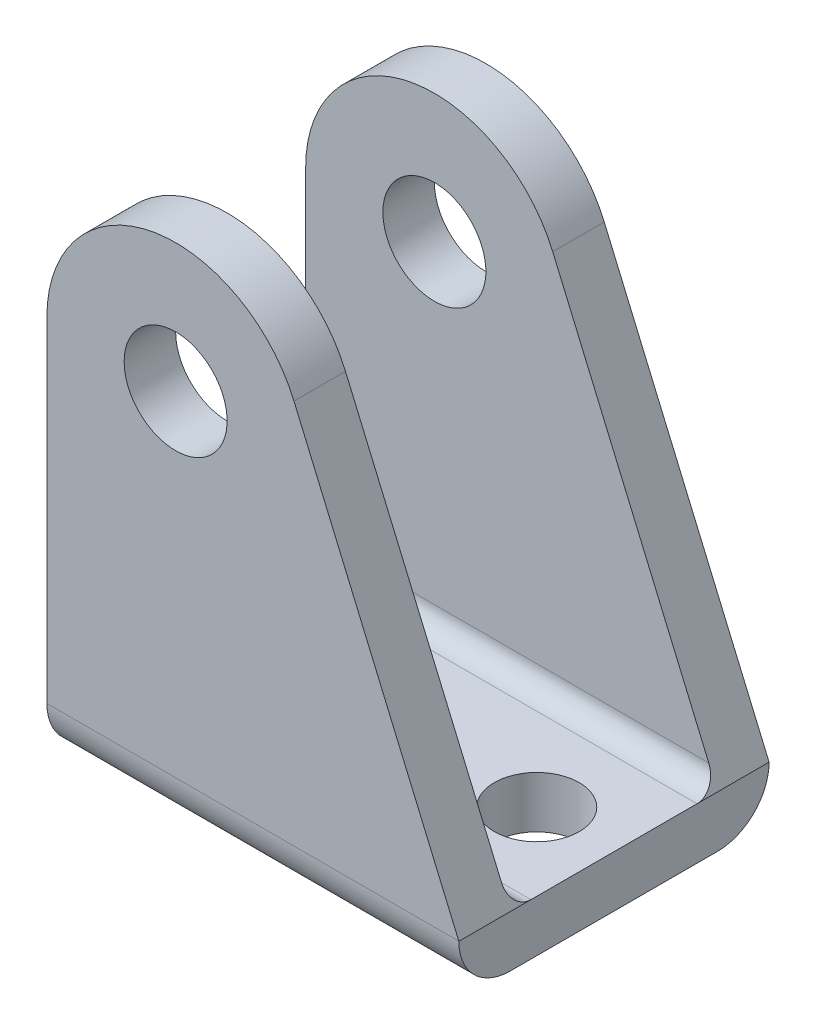
ISO-10303-21;
HEADER;
FILE_DESCRIPTION(('STEP AP214'),'2;1');
FILE_NAME('part.step','',(''),(''),'','','');
FILE_SCHEMA(('AUTOMOTIVE_DESIGN { 1 0 10303 214 1 1 1 1 }'));
ENDSEC;
DATA;
#1=APPLICATION_CONTEXT('core data for automotive mechanical design processes');
#2=APPLICATION_PROTOCOL_DEFINITION('international standard','automotive_design',2000,#1);
#3=PRODUCT_CONTEXT('',#1,'mechanical');
#4=PRODUCT('Part','Part','',(#3));
#5=PRODUCT_RELATED_PRODUCT_CATEGORY('part','',(#4));
#6=PRODUCT_DEFINITION_FORMATION('','',#4);
#7=PRODUCT_DEFINITION_CONTEXT('part definition',#1,'design');
#8=PRODUCT_DEFINITION('design','',#6,#7);
#9=PRODUCT_DEFINITION_SHAPE('','',#8);
#10=(LENGTH_UNIT() NAMED_UNIT(*) SI_UNIT(.MILLI.,.METRE.));
#11=(NAMED_UNIT(*) PLANE_ANGLE_UNIT() SI_UNIT($,.RADIAN.));
#12=(NAMED_UNIT(*) SI_UNIT($,.STERADIAN.) SOLID_ANGLE_UNIT());
#13=UNCERTAINTY_MEASURE_WITH_UNIT(LENGTH_MEASURE(1.E-05),#10,'distance_accuracy_value','');
#14=(GEOMETRIC_REPRESENTATION_CONTEXT(3) GLOBAL_UNCERTAINTY_ASSIGNED_CONTEXT((#13)) GLOBAL_UNIT_ASSIGNED_CONTEXT((#10,
#11,#12)) REPRESENTATION_CONTEXT('',''));
#15=CARTESIAN_POINT('',(0.,0.,0.));
#16=DIRECTION('',(0.,0.,1.));
#17=DIRECTION('',(1.,0.,0.));
#18=AXIS2_PLACEMENT_3D('',#15,#16,#17);
#19=CARTESIAN_POINT('',(32.,3.99999999999998,8.05000000000002));
#20=DIRECTION('',(-1.,0.,0.));
#21=DIRECTION('',(0.,0.,1.));
#22=AXIS2_PLACEMENT_3D('',#19,#20,#21);
#23=CYLINDRICAL_SURFACE('',#22,3.99999999999998);
#24=DIRECTION('',(-1.,0.,0.));
#25=VECTOR('',#24,1.);
#26=CARTESIAN_POINT('',(32.,4.,12.05));
#27=LINE('',#26,#25);
#28=CARTESIAN_POINT('',(32.,4.,12.05));
#29=VERTEX_POINT('',#28);
#30=CARTESIAN_POINT('',(0.,4.,12.05));
#31=VERTEX_POINT('',#30);
#32=EDGE_CURVE('E146',#29,#31,#27,.T.);
#33=ORIENTED_EDGE('',*,*,#32,.T.);
#34=CARTESIAN_POINT('',(0.,3.99999999999998,8.05000000000002));
#35=DIRECTION('',(1.,0.,0.));
#36=DIRECTION('',(0.,0.,-1.));
#37=AXIS2_PLACEMENT_3D('',#34,#35,#36);
#38=CIRCLE('',#37,3.99999999999998);
#39=CARTESIAN_POINT('',(0.,0.,8.05));
#40=VERTEX_POINT('',#39);
#41=EDGE_CURVE('E164',#31,#40,#38,.T.);
#42=ORIENTED_EDGE('',*,*,#41,.T.);
#43=DIRECTION('',(-1.,0.,0.));
#44=VECTOR('',#43,1.);
#45=CARTESIAN_POINT('',(32.,0.,8.05));
#46=LINE('',#45,#44);
#47=CARTESIAN_POINT('',(32.,0.,8.05));
#48=VERTEX_POINT('',#47);
#49=EDGE_CURVE('E222',#48,#40,#46,.T.);
#50=ORIENTED_EDGE('',*,*,#49,.F.);
#51=CARTESIAN_POINT('',(32.,3.99999999999998,8.05000000000002));
#52=DIRECTION('',(1.,0.,0.));
#53=DIRECTION('',(0.,0.,-1.));
#54=AXIS2_PLACEMENT_3D('',#51,#52,#53);
#55=CIRCLE('',#54,3.99999999999998);
#56=EDGE_CURVE('E195',#29,#48,#55,.T.);
#57=ORIENTED_EDGE('',*,*,#56,.F.);
#58=EDGE_LOOP('',(#33,#42,#50,#57));
#59=FACE_BOUND('',#58,.T.);
#60=ADVANCED_FACE('F33',(#59),#23,.T.);
#61=CARTESIAN_POINT('',(32.,0.,8.05));
#62=DIRECTION('',(0.,1.,0.));
#63=DIRECTION('',(0.,0.,1.));
#64=AXIS2_PLACEMENT_3D('',#61,#62,#63);
#65=PLANE('',#64);
#66=CARTESIAN_POINT('',(26.,0.,0.));
#67=DIRECTION('',(0.,1.,0.));
#68=DIRECTION('',(0.,0.,1.));
#69=AXIS2_PLACEMENT_3D('',#66,#67,#68);
#70=CIRCLE('',#69,3.3);
#71=CARTESIAN_POINT('',(26.,0.,3.3));
#72=VERTEX_POINT('',#71);
#73=EDGE_CURVE('E267',#72,#72,#70,.F.);
#74=ORIENTED_EDGE('',*,*,#73,.F.);
#75=EDGE_LOOP('',(#74));
#76=FACE_BOUND('',#75,.T.);
#77=CARTESIAN_POINT('',(6.,0.,0.));
#78=DIRECTION('',(0.,1.,0.));
#79=DIRECTION('',(0.,0.,1.));
#80=AXIS2_PLACEMENT_3D('',#77,#78,#79);
#81=CIRCLE('',#80,3.3);
#82=CARTESIAN_POINT('',(6.,0.,3.3));
#83=VERTEX_POINT('',#82);
#84=EDGE_CURVE('E261',#83,#83,#81,.F.);
#85=ORIENTED_EDGE('',*,*,#84,.F.);
#86=EDGE_LOOP('',(#85));
#87=FACE_BOUND('',#86,.T.);
#88=ORIENTED_EDGE('',*,*,#49,.T.);
#89=DIRECTION('',(0.,0.,-1.));
#90=VECTOR('',#89,1.);
#91=CARTESIAN_POINT('',(0.,0.,32.));
#92=LINE('',#91,#90);
#93=CARTESIAN_POINT('',(0.,0.,-8.05000000000001));
#94=VERTEX_POINT('',#93);
#95=EDGE_CURVE('E140',#40,#94,#92,.T.);
#96=ORIENTED_EDGE('',*,*,#95,.T.);
#97=DIRECTION('',(-1.,0.,0.));
#98=VECTOR('',#97,1.);
#99=CARTESIAN_POINT('',(32.,0.,-8.05));
#100=LINE('',#99,#98);
#101=CARTESIAN_POINT('',(32.,0.,-8.05));
#102=VERTEX_POINT('',#101);
#103=EDGE_CURVE('E219',#102,#94,#100,.T.);
#104=ORIENTED_EDGE('',*,*,#103,.F.);
#105=DIRECTION('',(0.,0.,-1.));
#106=VECTOR('',#105,1.);
#107=CARTESIAN_POINT('',(32.,0.,8.05));
#108=LINE('',#107,#106);
#109=EDGE_CURVE('E56',#48,#102,#108,.T.);
#110=ORIENTED_EDGE('',*,*,#109,.F.);
#111=EDGE_LOOP('',(#88,#96,#104,#110));
#112=FACE_BOUND('',#111,.T.);
#113=ADVANCED_FACE('F289',(#76,#87,#112),#65,.F.);
#114=CARTESIAN_POINT('',(32.,3.99999999999998,-8.05000000000002));
#115=DIRECTION('',(-1.,0.,0.));
#116=DIRECTION('',(0.,0.,1.));
#117=AXIS2_PLACEMENT_3D('',#114,#115,#116);
#118=CYLINDRICAL_SURFACE('',#117,3.99999999999998);
#119=ORIENTED_EDGE('',*,*,#103,.T.);
#120=CARTESIAN_POINT('',(0.,3.99999999999998,-8.05000000000002));
#121=DIRECTION('',(1.,0.,0.));
#122=DIRECTION('',(0.,0.,-1.));
#123=AXIS2_PLACEMENT_3D('',#120,#121,#122);
#124=CIRCLE('',#123,3.99999999999998);
#125=CARTESIAN_POINT('',(0.,4.,-12.05));
#126=VERTEX_POINT('',#125);
#127=EDGE_CURVE('E185',#94,#126,#124,.T.);
#128=ORIENTED_EDGE('',*,*,#127,.T.);
#129=DIRECTION('',(-1.,0.,0.));
#130=VECTOR('',#129,1.);
#131=CARTESIAN_POINT('',(32.,4.,-12.05));
#132=LINE('',#131,#130);
#133=CARTESIAN_POINT('',(32.,4.,-12.05));
#134=VERTEX_POINT('',#133);
#135=EDGE_CURVE('E216',#134,#126,#132,.T.);
#136=ORIENTED_EDGE('',*,*,#135,.F.);
#137=CARTESIAN_POINT('',(32.,3.99999999999998,-8.05000000000002));
#138=DIRECTION('',(1.,0.,0.));
#139=DIRECTION('',(0.,0.,-1.));
#140=AXIS2_PLACEMENT_3D('',#137,#138,#139);
#141=CIRCLE('',#140,3.99999999999998);
#142=EDGE_CURVE('E198',#102,#134,#141,.T.);
#143=ORIENTED_EDGE('',*,*,#142,.F.);
#144=EDGE_LOOP('',(#119,#128,#136,#143));
#145=FACE_BOUND('',#144,.T.);
#146=ADVANCED_FACE('F291',(#145),#118,.T.);
#147=CARTESIAN_POINT('',(32.,4.,-12.05));
#148=DIRECTION('',(0.,0.,1.));
#149=DIRECTION('',(1.,0.,0.));
#150=AXIS2_PLACEMENT_3D('',#147,#148,#149);
#151=PLANE('',#150);
#152=CARTESIAN_POINT('',(10.,30.,-12.05));
#153=DIRECTION('',(0.,0.,1.));
#154=DIRECTION('',(1.,0.,0.));
#155=AXIS2_PLACEMENT_3D('',#152,#153,#154);
#156=CIRCLE('',#155,4.);
#157=CARTESIAN_POINT('',(14.,30.,-12.05));
#158=VERTEX_POINT('',#157);
#159=EDGE_CURVE('E252',#158,#158,#156,.F.);
#160=ORIENTED_EDGE('',*,*,#159,.F.);
#161=EDGE_LOOP('',(#160));
#162=FACE_BOUND('',#161,.T.);
#163=ORIENTED_EDGE('',*,*,#135,.T.);
#164=DIRECTION('',(0.,1.,0.));
#165=VECTOR('',#164,1.);
#166=CARTESIAN_POINT('',(0.,4.,-12.05));
#167=LINE('',#166,#165);
#168=CARTESIAN_POINT('',(0.,30.,-12.05));
#169=VERTEX_POINT('',#168);
#170=EDGE_CURVE('E182',#126,#169,#167,.T.);
#171=ORIENTED_EDGE('',*,*,#170,.T.);
#172=CARTESIAN_POINT('',(10.,30.,-12.05));
#173=DIRECTION('',(0.,0.,1.));
#174=DIRECTION('',(1.,0.,0.));
#175=AXIS2_PLACEMENT_3D('',#172,#173,#174);
#176=CIRCLE('',#175,10.);
#177=CARTESIAN_POINT('',(19.1939540603206,33.9333457433482,-12.05));
#178=VERTEX_POINT('',#177);
#179=EDGE_CURVE('E193',#169,#178,#176,.F.);
#180=ORIENTED_EDGE('',*,*,#179,.T.);
#181=DIRECTION('',(0.393334574334815,-0.919395406032056,0.));
#182=VECTOR('',#181,1.);
#183=CARTESIAN_POINT('',(32.,4.,-12.05));
#184=LINE('',#183,#182);
#185=EDGE_CURVE('E161',#178,#134,#184,.T.);
#186=ORIENTED_EDGE('',*,*,#185,.T.);
#187=EDGE_LOOP('',(#163,#171,#180,#186));
#188=FACE_BOUND('',#187,.T.);
#189=ADVANCED_FACE('F299',(#162,#188),#151,.F.);
#190=CARTESIAN_POINT('',(32.,40.,-8.05));
#191=DIRECTION('',(0.,0.,-1.));
#192=DIRECTION('',(-1.,0.,0.));
#193=AXIS2_PLACEMENT_3D('',#190,#191,#192);
#194=PLANE('',#193);
#195=CARTESIAN_POINT('',(10.,30.,-8.05));
#196=DIRECTION('',(0.,0.,-1.));
#197=DIRECTION('',(-1.,0.,0.));
#198=AXIS2_PLACEMENT_3D('',#195,#196,#197);
#199=CIRCLE('',#198,4.);
#200=CARTESIAN_POINT('',(6.,30.,-8.05));
#201=VERTEX_POINT('',#200);
#202=EDGE_CURVE('E255',#201,#201,#199,.F.);
#203=ORIENTED_EDGE('',*,*,#202,.F.);
#204=EDGE_LOOP('',(#203));
#205=FACE_BOUND('',#204,.T.);
#206=CARTESIAN_POINT('',(10.,30.,-8.05));
#207=DIRECTION('',(0.,0.,-1.));
#208=DIRECTION('',(-1.,0.,0.));
#209=AXIS2_PLACEMENT_3D('',#206,#207,#208);
#210=CIRCLE('',#209,10.);
#211=CARTESIAN_POINT('',(19.1939540603206,33.9333457433482,-8.05));
#212=VERTEX_POINT('',#211);
#213=CARTESIAN_POINT('',(0.,30.,-8.05));
#214=VERTEX_POINT('',#213);
#215=EDGE_CURVE('E190',#212,#214,#210,.F.);
#216=ORIENTED_EDGE('',*,*,#215,.T.);
#217=DIRECTION('',(0.,-1.,0.));
#218=VECTOR('',#217,1.);
#219=CARTESIAN_POINT('',(0.,40.,-8.05));
#220=LINE('',#219,#218);
#221=CARTESIAN_POINT('',(0.,5.59999999999999,-8.05));
#222=VERTEX_POINT('',#221);
#223=EDGE_CURVE('E179',#214,#222,#220,.T.);
#224=ORIENTED_EDGE('',*,*,#223,.T.);
#225=DIRECTION('',(-1.,0.,0.));
#226=VECTOR('',#225,1.);
#227=CARTESIAN_POINT('',(32.,5.6,-8.05));
#228=LINE('',#227,#226);
#229=CARTESIAN_POINT('',(31.3154900331166,5.6,-8.05));
#230=VERTEX_POINT('',#229);
#231=EDGE_CURVE('E213',#230,#222,#228,.T.);
#232=ORIENTED_EDGE('',*,*,#231,.F.);
#233=DIRECTION('',(-0.393334574334815,0.919395406032056,0.));
#234=VECTOR('',#233,1.);
#235=CARTESIAN_POINT('',(18.9813199756279,34.4303648547826,-8.05));
#236=LINE('',#235,#234);
#237=EDGE_CURVE('E158',#230,#212,#236,.T.);
#238=ORIENTED_EDGE('',*,*,#237,.T.);
#239=EDGE_LOOP('',(#216,#224,#232,#238));
#240=FACE_BOUND('',#239,.T.);
#241=ADVANCED_FACE('F242',(#205,#240),#194,.F.);
#242=CARTESIAN_POINT('',(32.,5.59999999999999,-6.45000000000001));
#243=DIRECTION('',(-1.,0.,0.));
#244=DIRECTION('',(0.,0.,1.));
#245=AXIS2_PLACEMENT_3D('',#242,#243,#244);
#246=CYLINDRICAL_SURFACE('',#245,1.59999999999999);
#247=ORIENTED_EDGE('',*,*,#231,.T.);
#248=CARTESIAN_POINT('',(0.,5.59999999999999,-6.45000000000001));
#249=DIRECTION('',(1.,0.,0.));
#250=DIRECTION('',(0.,0.,-1.));
#251=AXIS2_PLACEMENT_3D('',#248,#249,#250);
#252=CIRCLE('',#251,1.59999999999999);
#253=CARTESIAN_POINT('',(0.,4.,-6.45));
#254=VERTEX_POINT('',#253);
#255=EDGE_CURVE('E176',#222,#254,#252,.F.);
#256=ORIENTED_EDGE('',*,*,#255,.T.);
#257=DIRECTION('',(-1.,0.,0.));
#258=VECTOR('',#257,1.);
#259=CARTESIAN_POINT('',(32.,4.,-6.45));
#260=LINE('',#259,#258);
#261=CARTESIAN_POINT('',(32.,4.,-6.45));
#262=VERTEX_POINT('',#261);
#263=EDGE_CURVE('E210',#262,#254,#260,.T.);
#264=ORIENTED_EDGE('',*,*,#263,.F.);
#265=CARTESIAN_POINT('',(31.3154900331167,5.59999999999999,-6.45000000000001));
#266=DIRECTION('',(-0.919395406032056,-0.393334574334815,0.));
#267=DIRECTION('',(-0.393334574334815,0.919395406032056,0.));
#268=AXIS2_PLACEMENT_3D('',#265,#266,#267);
#269=ELLIPSE('',#268,1.74027408610328,1.59999999999999);
#270=EDGE_CURVE('E48',#262,#230,#269,.F.);
#271=ORIENTED_EDGE('',*,*,#270,.T.);
#272=EDGE_LOOP('',(#247,#256,#264,#271));
#273=FACE_BOUND('',#272,.T.);
#274=ADVANCED_FACE('F239',(#273),#246,.F.);
#275=CARTESIAN_POINT('',(32.,4.,-6.45));
#276=DIRECTION('',(0.,-1.,0.));
#277=DIRECTION('',(0.,0.,-1.));
#278=AXIS2_PLACEMENT_3D('',#275,#276,#277);
#279=PLANE('',#278);
#280=CARTESIAN_POINT('',(26.,4.,0.));
#281=DIRECTION('',(0.,1.,0.));
#282=DIRECTION('',(0.,0.,1.));
#283=AXIS2_PLACEMENT_3D('',#280,#281,#282);
#284=CIRCLE('',#283,3.3);
#285=CARTESIAN_POINT('',(26.,4.,3.3));
#286=VERTEX_POINT('',#285);
#287=EDGE_CURVE('E270',#286,#286,#284,.T.);
#288=ORIENTED_EDGE('',*,*,#287,.F.);
#289=EDGE_LOOP('',(#288));
#290=FACE_BOUND('',#289,.T.);
#291=CARTESIAN_POINT('',(6.,4.,0.));
#292=DIRECTION('',(0.,1.,0.));
#293=DIRECTION('',(0.,0.,1.));
#294=AXIS2_PLACEMENT_3D('',#291,#292,#293);
#295=CIRCLE('',#294,3.3);
#296=CARTESIAN_POINT('',(6.,4.,3.3));
#297=VERTEX_POINT('',#296);
#298=EDGE_CURVE('E264',#297,#297,#295,.T.);
#299=ORIENTED_EDGE('',*,*,#298,.F.);
#300=EDGE_LOOP('',(#299));
#301=FACE_BOUND('',#300,.T.);
#302=ORIENTED_EDGE('',*,*,#263,.T.);
#303=DIRECTION('',(0.,0.,1.));
#304=VECTOR('',#303,1.);
#305=CARTESIAN_POINT('',(0.,4.,-6.45));
#306=LINE('',#305,#304);
#307=CARTESIAN_POINT('',(0.,4.,6.45));
#308=VERTEX_POINT('',#307);
#309=EDGE_CURVE('E173',#254,#308,#306,.T.);
#310=ORIENTED_EDGE('',*,*,#309,.T.);
#311=DIRECTION('',(-1.,0.,0.));
#312=VECTOR('',#311,1.);
#313=CARTESIAN_POINT('',(32.,4.,6.45));
#314=LINE('',#313,#312);
#315=CARTESIAN_POINT('',(32.,4.,6.45));
#316=VERTEX_POINT('',#315);
#317=EDGE_CURVE('E207',#316,#308,#314,.T.);
#318=ORIENTED_EDGE('',*,*,#317,.F.);
#319=DIRECTION('',(0.,0.,1.));
#320=VECTOR('',#319,1.);
#321=CARTESIAN_POINT('',(32.,4.,-6.45));
#322=LINE('',#321,#320);
#323=EDGE_CURVE('E200',#262,#316,#322,.T.);
#324=ORIENTED_EDGE('',*,*,#323,.F.);
#325=EDGE_LOOP('',(#302,#310,#318,#324));
#326=FACE_BOUND('',#325,.T.);
#327=ADVANCED_FACE('F235',(#290,#301,#326),#279,.F.);
#328=CARTESIAN_POINT('',(32.,5.59999999999999,6.45000000000001));
#329=DIRECTION('',(-1.,0.,0.));
#330=DIRECTION('',(0.,0.,1.));
#331=AXIS2_PLACEMENT_3D('',#328,#329,#330);
#332=CYLINDRICAL_SURFACE('',#331,1.59999999999999);
#333=ORIENTED_EDGE('',*,*,#317,.T.);
#334=CARTESIAN_POINT('',(0.,5.59999999999999,6.45000000000001));
#335=DIRECTION('',(1.,0.,0.));
#336=DIRECTION('',(0.,0.,-1.));
#337=AXIS2_PLACEMENT_3D('',#334,#335,#336);
#338=CIRCLE('',#337,1.59999999999999);
#339=CARTESIAN_POINT('',(0.,5.6,8.05));
#340=VERTEX_POINT('',#339);
#341=EDGE_CURVE('E170',#308,#340,#338,.F.);
#342=ORIENTED_EDGE('',*,*,#341,.T.);
#343=DIRECTION('',(-1.,0.,0.));
#344=VECTOR('',#343,1.);
#345=CARTESIAN_POINT('',(32.,5.6,8.05));
#346=LINE('',#345,#344);
#347=CARTESIAN_POINT('',(31.3154900331167,5.6,8.05));
#348=VERTEX_POINT('',#347);
#349=EDGE_CURVE('E204',#348,#340,#346,.T.);
#350=ORIENTED_EDGE('',*,*,#349,.F.);
#351=CARTESIAN_POINT('',(31.3154900331167,5.59999999999999,6.45000000000001));
#352=DIRECTION('',(-0.919395406032056,-0.393334574334815,0.));
#353=DIRECTION('',(-0.393334574334815,0.919395406032056,0.));
#354=AXIS2_PLACEMENT_3D('',#351,#352,#353);
#355=ELLIPSE('',#354,1.74027408610328,1.59999999999999);
#356=EDGE_CURVE('E149',#348,#316,#355,.F.);
#357=ORIENTED_EDGE('',*,*,#356,.T.);
#358=EDGE_LOOP('',(#333,#342,#350,#357));
#359=FACE_BOUND('',#358,.T.);
#360=ADVANCED_FACE('F229',(#359),#332,.F.);
#361=CARTESIAN_POINT('',(32.,5.6,8.05));
#362=DIRECTION('',(0.,0.,1.));
#363=DIRECTION('',(1.,0.,0.));
#364=AXIS2_PLACEMENT_3D('',#361,#362,#363);
#365=PLANE('',#364);
#366=CARTESIAN_POINT('',(10.,30.,8.05));
#367=DIRECTION('',(0.,0.,1.));
#368=DIRECTION('',(1.,0.,0.));
#369=AXIS2_PLACEMENT_3D('',#366,#367,#368);
#370=CIRCLE('',#369,4.);
#371=CARTESIAN_POINT('',(14.,30.,8.05));
#372=VERTEX_POINT('',#371);
#373=EDGE_CURVE('E258',#372,#372,#370,.F.);
#374=ORIENTED_EDGE('',*,*,#373,.F.);
#375=EDGE_LOOP('',(#374));
#376=FACE_BOUND('',#375,.T.);
#377=ORIENTED_EDGE('',*,*,#349,.T.);
#378=DIRECTION('',(0.,1.,0.));
#379=VECTOR('',#378,1.);
#380=CARTESIAN_POINT('',(0.,5.6,8.05));
#381=LINE('',#380,#379);
#382=CARTESIAN_POINT('',(0.,30.,8.05));
#383=VERTEX_POINT('',#382);
#384=EDGE_CURVE('E167',#340,#383,#381,.T.);
#385=ORIENTED_EDGE('',*,*,#384,.T.);
#386=CARTESIAN_POINT('',(10.,30.,8.05));
#387=DIRECTION('',(0.,0.,1.));
#388=DIRECTION('',(1.,0.,0.));
#389=AXIS2_PLACEMENT_3D('',#386,#387,#388);
#390=CIRCLE('',#389,10.);
#391=CARTESIAN_POINT('',(19.1939540603206,33.9333457433482,8.05));
#392=VERTEX_POINT('',#391);
#393=EDGE_CURVE('E188',#383,#392,#390,.F.);
#394=ORIENTED_EDGE('',*,*,#393,.T.);
#395=DIRECTION('',(0.393334574334815,-0.919395406032056,0.));
#396=VECTOR('',#395,1.);
#397=CARTESIAN_POINT('',(31.4213919989168,5.35246066021256,8.05));
#398=LINE('',#397,#396);
#399=EDGE_CURVE('E139',#392,#348,#398,.T.);
#400=ORIENTED_EDGE('',*,*,#399,.T.);
#401=EDGE_LOOP('',(#377,#385,#394,#400));
#402=FACE_BOUND('',#401,.T.);
#403=ADVANCED_FACE('F357',(#376,#402),#365,.F.);
#404=CARTESIAN_POINT('',(32.,40.,12.05));
#405=DIRECTION('',(0.,0.,-1.));
#406=DIRECTION('',(-1.,0.,0.));
#407=AXIS2_PLACEMENT_3D('',#404,#405,#406);
#408=PLANE('',#407);
#409=CARTESIAN_POINT('',(10.,30.,12.05));
#410=DIRECTION('',(0.,0.,-1.));
#411=DIRECTION('',(-1.,0.,0.));
#412=AXIS2_PLACEMENT_3D('',#409,#410,#411);
#413=CIRCLE('',#412,4.);
#414=CARTESIAN_POINT('',(6.,30.,12.05));
#415=VERTEX_POINT('',#414);
#416=EDGE_CURVE('E36',#415,#415,#413,.F.);
#417=ORIENTED_EDGE('',*,*,#416,.F.);
#418=EDGE_LOOP('',(#417));
#419=FACE_BOUND('',#418,.T.);
#420=CARTESIAN_POINT('',(10.,30.,12.05));
#421=DIRECTION('',(0.,0.,-1.));
#422=DIRECTION('',(-1.,0.,0.));
#423=AXIS2_PLACEMENT_3D('',#420,#421,#422);
#424=CIRCLE('',#423,10.);
#425=CARTESIAN_POINT('',(19.1939540603206,33.9333457433482,12.05));
#426=VERTEX_POINT('',#425);
#427=CARTESIAN_POINT('',(0.,30.,12.05));
#428=VERTEX_POINT('',#427);
#429=EDGE_CURVE('E41',#426,#428,#424,.F.);
#430=ORIENTED_EDGE('',*,*,#429,.T.);
#431=DIRECTION('',(0.,-1.,0.));
#432=VECTOR('',#431,1.);
#433=CARTESIAN_POINT('',(0.,40.,12.05));
#434=LINE('',#433,#432);
#435=EDGE_CURVE('E11',#428,#31,#434,.T.);
#436=ORIENTED_EDGE('',*,*,#435,.T.);
#437=ORIENTED_EDGE('',*,*,#32,.F.);
#438=DIRECTION('',(-0.393334574334815,0.919395406032056,0.));
#439=VECTOR('',#438,1.);
#440=CARTESIAN_POINT('',(18.9813199756279,34.4303648547826,12.05));
#441=LINE('',#440,#439);
#442=EDGE_CURVE('E136',#29,#426,#441,.T.);
#443=ORIENTED_EDGE('',*,*,#442,.T.);
#444=EDGE_LOOP('',(#430,#436,#437,#443));
#445=FACE_BOUND('',#444,.T.);
#446=ADVANCED_FACE('F144',(#419,#445),#408,.F.);
#447=CARTESIAN_POINT('',(32.,3.99999999999998,8.05000000000002));
#448=DIRECTION('',(1.,0.,0.));
#449=DIRECTION('',(0.,0.,-1.));
#450=AXIS2_PLACEMENT_3D('',#447,#448,#449);
#451=PLANE('',#450);
#452=DIRECTION('',(0.,0.,-1.));
#453=VECTOR('',#452,1.);
#454=CARTESIAN_POINT('',(32.,3.99999999999998,8.05000000000002));
#455=LINE('',#454,#453);
#456=EDGE_CURVE('E131',#29,#316,#455,.T.);
#457=ORIENTED_EDGE('',*,*,#456,.F.);
#458=ORIENTED_EDGE('',*,*,#56,.T.);
#459=ORIENTED_EDGE('',*,*,#109,.T.);
#460=ORIENTED_EDGE('',*,*,#142,.T.);
#461=EDGE_CURVE('E225',#262,#134,#455,.T.);
#462=ORIENTED_EDGE('',*,*,#461,.F.);
#463=ORIENTED_EDGE('',*,*,#323,.T.);
#464=EDGE_LOOP('',(#457,#458,#459,#460,#462,#463));
#465=FACE_BOUND('',#464,.T.);
#466=ADVANCED_FACE('F232',(#465),#451,.T.);
#467=CARTESIAN_POINT('',(10.,30.,32.));
#468=DIRECTION('',(0.,0.,-1.));
#469=DIRECTION('',(-1.,0.,0.));
#470=AXIS2_PLACEMENT_3D('',#467,#468,#469);
#471=CYLINDRICAL_SURFACE('',#470,10.);
#472=DIRECTION('',(0.,0.,-1.));
#473=VECTOR('',#472,1.);
#474=CARTESIAN_POINT('',(0.,30.,32.));
#475=LINE('',#474,#473);
#476=EDGE_CURVE('E151',#214,#169,#475,.T.);
#477=ORIENTED_EDGE('',*,*,#476,.F.);
#478=ORIENTED_EDGE('',*,*,#215,.F.);
#479=DIRECTION('',(0.,0.,-1.));
#480=VECTOR('',#479,1.);
#481=CARTESIAN_POINT('',(19.1939540603206,33.9333457433482,32.));
#482=LINE('',#481,#480);
#483=EDGE_CURVE('E141',#212,#178,#482,.T.);
#484=ORIENTED_EDGE('',*,*,#483,.T.);
#485=ORIENTED_EDGE('',*,*,#179,.F.);
#486=EDGE_LOOP('',(#477,#478,#484,#485));
#487=FACE_BOUND('',#486,.T.);
#488=ADVANCED_FACE('F246',(#487),#471,.T.);
#489=EDGE_CURVE('E127',#428,#383,#475,.T.);
#490=ORIENTED_EDGE('',*,*,#489,.F.);
#491=ORIENTED_EDGE('',*,*,#429,.F.);
#492=EDGE_CURVE('E125',#426,#392,#482,.T.);
#493=ORIENTED_EDGE('',*,*,#492,.T.);
#494=ORIENTED_EDGE('',*,*,#393,.F.);
#495=EDGE_LOOP('',(#490,#491,#493,#494));
#496=FACE_BOUND('',#495,.T.);
#497=ADVANCED_FACE('F124',(#496),#471,.T.);
#498=CARTESIAN_POINT('',(0.,30.,32.));
#499=DIRECTION('',(1.,0.,0.));
#500=DIRECTION('',(0.,0.,-1.));
#501=AXIS2_PLACEMENT_3D('',#498,#499,#500);
#502=PLANE('',#501);
#503=ORIENTED_EDGE('',*,*,#95,.F.);
#504=ORIENTED_EDGE('',*,*,#41,.F.);
#505=ORIENTED_EDGE('',*,*,#435,.F.);
#506=ORIENTED_EDGE('',*,*,#489,.T.);
#507=ORIENTED_EDGE('',*,*,#384,.F.);
#508=ORIENTED_EDGE('',*,*,#341,.F.);
#509=ORIENTED_EDGE('',*,*,#309,.F.);
#510=ORIENTED_EDGE('',*,*,#255,.F.);
#511=ORIENTED_EDGE('',*,*,#223,.F.);
#512=ORIENTED_EDGE('',*,*,#476,.T.);
#513=ORIENTED_EDGE('',*,*,#170,.F.);
#514=ORIENTED_EDGE('',*,*,#127,.F.);
#515=EDGE_LOOP('',(#503,#504,#505,#506,#507,#508,#509,#510,#511,#512,#513,#514));
#516=FACE_BOUND('',#515,.T.);
#517=ADVANCED_FACE('F237',(#516),#502,.F.);
#518=CARTESIAN_POINT('',(32.,4.,32.));
#519=DIRECTION('',(-0.919395406032056,-0.393334574334815,0.));
#520=DIRECTION('',(0.393334574334815,-0.919395406032056,0.));
#521=AXIS2_PLACEMENT_3D('',#518,#519,#520);
#522=PLANE('',#521);
#523=ORIENTED_EDGE('',*,*,#483,.F.);
#524=ORIENTED_EDGE('',*,*,#237,.F.);
#525=ORIENTED_EDGE('',*,*,#270,.F.);
#526=ORIENTED_EDGE('',*,*,#461,.T.);
#527=ORIENTED_EDGE('',*,*,#185,.F.);
#528=EDGE_LOOP('',(#523,#524,#525,#526,#527));
#529=FACE_BOUND('',#528,.T.);
#530=ADVANCED_FACE('F300',(#529),#522,.F.);
#531=ORIENTED_EDGE('',*,*,#399,.F.);
#532=ORIENTED_EDGE('',*,*,#492,.F.);
#533=ORIENTED_EDGE('',*,*,#442,.F.);
#534=ORIENTED_EDGE('',*,*,#456,.T.);
#535=ORIENTED_EDGE('',*,*,#356,.F.);
#536=EDGE_LOOP('',(#531,#532,#533,#534,#535));
#537=FACE_BOUND('',#536,.T.);
#538=ADVANCED_FACE('F135',(#537),#522,.F.);
#539=CARTESIAN_POINT('',(10.,30.,16.1));
#540=DIRECTION('',(0.,0.,-1.));
#541=DIRECTION('',(-1.,0.,0.));
#542=AXIS2_PLACEMENT_3D('',#539,#540,#541);
#543=CYLINDRICAL_SURFACE('',#542,4.);
#544=ORIENTED_EDGE('',*,*,#416,.T.);
#545=EDGE_LOOP('',(#544));
#546=FACE_BOUND('',#545,.T.);
#547=ORIENTED_EDGE('',*,*,#373,.T.);
#548=EDGE_LOOP('',(#547));
#549=FACE_BOUND('',#548,.T.);
#550=ADVANCED_FACE('F307',(#546,#549),#543,.F.);
#551=ORIENTED_EDGE('',*,*,#202,.T.);
#552=EDGE_LOOP('',(#551));
#553=FACE_BOUND('',#552,.T.);
#554=ORIENTED_EDGE('',*,*,#159,.T.);
#555=EDGE_LOOP('',(#554));
#556=FACE_BOUND('',#555,.T.);
#557=ADVANCED_FACE('F285',(#553,#556),#543,.F.);
#558=CARTESIAN_POINT('',(6.,4.,0.));
#559=DIRECTION('',(0.,-1.,0.));
#560=DIRECTION('',(0.,0.,-1.));
#561=AXIS2_PLACEMENT_3D('',#558,#559,#560);
#562=CYLINDRICAL_SURFACE('',#561,3.3);
#563=ORIENTED_EDGE('',*,*,#298,.T.);
#564=EDGE_LOOP('',(#563));
#565=FACE_BOUND('',#564,.T.);
#566=ORIENTED_EDGE('',*,*,#84,.T.);
#567=EDGE_LOOP('',(#566));
#568=FACE_BOUND('',#567,.T.);
#569=ADVANCED_FACE('F282',(#565,#568),#562,.F.);
#570=CARTESIAN_POINT('',(26.,4.,0.));
#571=DIRECTION('',(0.,-1.,0.));
#572=DIRECTION('',(0.,0.,-1.));
#573=AXIS2_PLACEMENT_3D('',#570,#571,#572);
#574=CYLINDRICAL_SURFACE('',#573,3.3);
#575=ORIENTED_EDGE('',*,*,#287,.T.);
#576=EDGE_LOOP('',(#575));
#577=FACE_BOUND('',#576,.T.);
#578=ORIENTED_EDGE('',*,*,#73,.T.);
#579=EDGE_LOOP('',(#578));
#580=FACE_BOUND('',#579,.T.);
#581=ADVANCED_FACE('F274',(#577,#580),#574,.F.);
#582=CLOSED_SHELL('',(#60,#113,#146,#189,#241,#274,#327,#360,#403,#446,#466,#488,#497,#517,#530,
#538,#550,#557,#569,#581));
#583=MANIFOLD_SOLID_BREP('B2',#582);
#584=ADVANCED_BREP_SHAPE_REPRESENTATION('',(#18,#583),#14);
#585=SHAPE_DEFINITION_REPRESENTATION(#9,#584);
ENDSEC;
END-ISO-10303-21;
